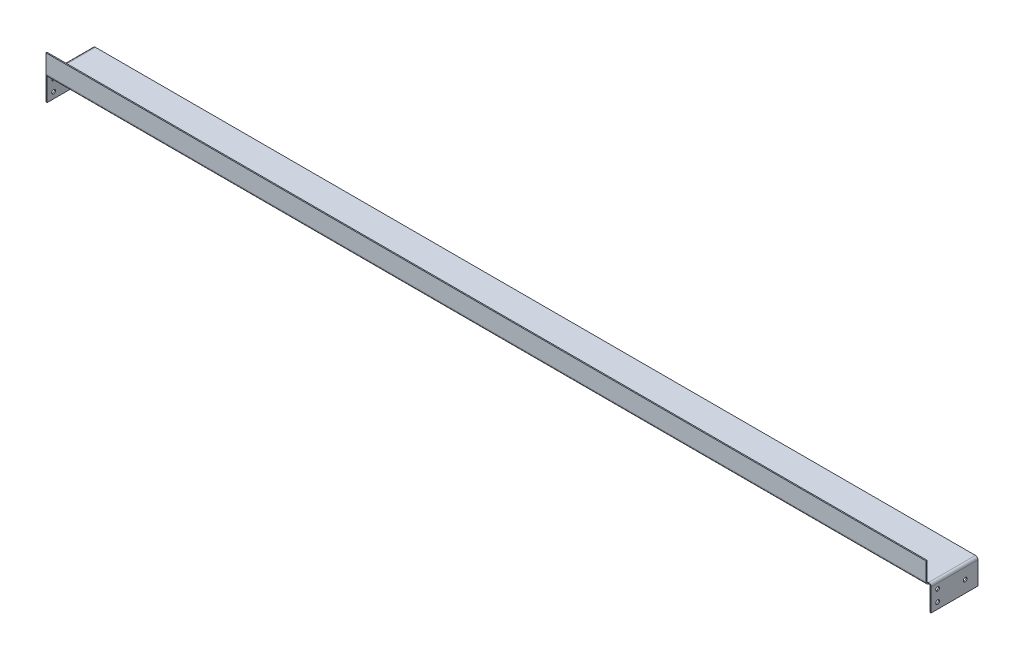
ISO-10303-21;
HEADER;
FILE_DESCRIPTION(('STEP AP214'),'2;1');
FILE_NAME('part.step','',(''),(''),'','','');
FILE_SCHEMA(('AUTOMOTIVE_DESIGN { 1 0 10303 214 1 1 1 1 }'));
ENDSEC;
DATA;
#1=APPLICATION_CONTEXT('core data for automotive mechanical design processes');
#2=APPLICATION_PROTOCOL_DEFINITION('international standard','automotive_design',2000,#1);
#3=PRODUCT_CONTEXT('',#1,'mechanical');
#4=PRODUCT('Part','Part','',(#3));
#5=PRODUCT_RELATED_PRODUCT_CATEGORY('part','',(#4));
#6=PRODUCT_DEFINITION_FORMATION('','',#4);
#7=PRODUCT_DEFINITION_CONTEXT('part definition',#1,'design');
#8=PRODUCT_DEFINITION('design','',#6,#7);
#9=PRODUCT_DEFINITION_SHAPE('','',#8);
#10=(LENGTH_UNIT() NAMED_UNIT(*) SI_UNIT(.MILLI.,.METRE.));
#11=(NAMED_UNIT(*) PLANE_ANGLE_UNIT() SI_UNIT($,.RADIAN.));
#12=(NAMED_UNIT(*) SI_UNIT($,.STERADIAN.) SOLID_ANGLE_UNIT());
#13=UNCERTAINTY_MEASURE_WITH_UNIT(LENGTH_MEASURE(1.E-05),#10,'distance_accuracy_value','');
#14=(GEOMETRIC_REPRESENTATION_CONTEXT(3) GLOBAL_UNCERTAINTY_ASSIGNED_CONTEXT((#13)) GLOBAL_UNIT_ASSIGNED_CONTEXT((#10,
#11,#12)) REPRESENTATION_CONTEXT('',''));
#15=CARTESIAN_POINT('',(0.,0.,0.));
#16=DIRECTION('',(0.,0.,1.));
#17=DIRECTION('',(1.,0.,0.));
#18=AXIS2_PLACEMENT_3D('',#15,#16,#17);
#19=CARTESIAN_POINT('',(-385.123575366,1131.04784336,59.2634000000001));
#20=DIRECTION('',(0.,-1.,0.));
#21=DIRECTION('',(-1.,0.,0.));
#22=AXIS2_PLACEMENT_3D('',#19,#20,#21);
#23=PLANE('',#22);
#24=DIRECTION('',(0.,0.,-1.));
#25=VECTOR('',#24,1.);
#26=CARTESIAN_POINT('',(-385.123575366,1131.04784336,59.2634000000001));
#27=LINE('',#26,#25);
#28=CARTESIAN_POINT('',(-385.123575366,1131.04784336,60.5634000000001));
#29=VERTEX_POINT('',#28);
#30=CARTESIAN_POINT('',(-385.123575366,1131.04784336,59.2634000000001));
#31=VERTEX_POINT('',#30);
#32=EDGE_CURVE('E13',#29,#31,#27,.T.);
#33=ORIENTED_EDGE('',*,*,#32,.F.);
#34=DIRECTION('',(-1.,0.,0.));
#35=VECTOR('',#34,1.);
#36=CARTESIAN_POINT('',(0.,1131.04784336,60.5634000000001));
#37=LINE('',#36,#35);
#38=CARTESIAN_POINT('',(661.403224634,1131.04784336,60.5634000000001));
#39=VERTEX_POINT('',#38);
#40=EDGE_CURVE('E154',#39,#29,#37,.T.);
#41=ORIENTED_EDGE('',*,*,#40,.F.);
#42=DIRECTION('',(0.,0.,-1.));
#43=VECTOR('',#42,1.);
#44=CARTESIAN_POINT('',(661.403224634,1131.04784336,59.2634000000001));
#45=LINE('',#44,#43);
#46=CARTESIAN_POINT('',(661.403224634,1131.04784336,59.2634000000001));
#47=VERTEX_POINT('',#46);
#48=EDGE_CURVE('E89',#39,#47,#45,.T.);
#49=ORIENTED_EDGE('',*,*,#48,.T.);
#50=DIRECTION('',(-1.,0.,0.));
#51=VECTOR('',#50,1.);
#52=CARTESIAN_POINT('',(-385.123575366,1131.04784336,59.2634000000001));
#53=LINE('',#52,#51);
#54=EDGE_CURVE('E332',#47,#31,#53,.T.);
#55=ORIENTED_EDGE('',*,*,#54,.T.);
#56=EDGE_LOOP('',(#33,#41,#49,#55));
#57=FACE_BOUND('',#56,.T.);
#58=ADVANCED_FACE('F79',(#57),#23,.F.);
#59=CARTESIAN_POINT('',(661.403224634,1131.04784336,59.2634000000001));
#60=DIRECTION('',(-1.,0.,0.));
#61=DIRECTION('',(0.,1.,0.));
#62=AXIS2_PLACEMENT_3D('',#59,#60,#61);
#63=PLANE('',#62);
#64=ORIENTED_EDGE('',*,*,#48,.F.);
#65=DIRECTION('',(0.,1.,0.));
#66=VECTOR('',#65,1.);
#67=CARTESIAN_POINT('',(661.403224634,0.,60.5634000000001));
#68=LINE('',#67,#66);
#69=CARTESIAN_POINT('',(661.403224634,1109.08784336,60.5634000000001));
#70=VERTEX_POINT('',#69);
#71=EDGE_CURVE('E151',#70,#39,#68,.T.);
#72=ORIENTED_EDGE('',*,*,#71,.F.);
#73=DIRECTION('',(0.,0.,-1.));
#74=VECTOR('',#73,1.);
#75=CARTESIAN_POINT('',(661.403224634,1109.08784336,59.2634000000001));
#76=LINE('',#75,#74);
#77=CARTESIAN_POINT('',(661.403224634,1109.08784336,59.2634000000001));
#78=VERTEX_POINT('',#77);
#79=EDGE_CURVE('E186',#70,#78,#76,.T.);
#80=ORIENTED_EDGE('',*,*,#79,.T.);
#81=DIRECTION('',(0.,1.,0.));
#82=VECTOR('',#81,1.);
#83=CARTESIAN_POINT('',(661.403224634,1131.04784336,59.2634000000001));
#84=LINE('',#83,#82);
#85=EDGE_CURVE('E325',#78,#47,#84,.T.);
#86=ORIENTED_EDGE('',*,*,#85,.T.);
#87=EDGE_LOOP('',(#64,#72,#80,#86));
#88=FACE_BOUND('',#87,.T.);
#89=ADVANCED_FACE('F365',(#88),#63,.F.);
#90=CARTESIAN_POINT('',(661.403224634,1109.08784336,57.5234000000001));
#91=DIRECTION('',(-1.,0.,0.));
#92=DIRECTION('',(0.,0.,1.));
#93=AXIS2_PLACEMENT_3D('',#90,#91,#92);
#94=PLANE('',#93);
#95=ORIENTED_EDGE('',*,*,#79,.F.);
#96=CARTESIAN_POINT('',(661.403224634,1109.08784336,57.5234000000001));
#97=DIRECTION('',(1.,0.,0.));
#98=DIRECTION('',(0.,0.,-1.));
#99=AXIS2_PLACEMENT_3D('',#96,#97,#98);
#100=CIRCLE('',#99,3.04);
#101=CARTESIAN_POINT('',(661.403224634,1106.04784336,57.5234));
#102=VERTEX_POINT('',#101);
#103=EDGE_CURVE('E147',#70,#102,#100,.T.);
#104=ORIENTED_EDGE('',*,*,#103,.T.);
#105=DIRECTION('',(0.,1.,0.));
#106=VECTOR('',#105,1.);
#107=CARTESIAN_POINT('',(661.403224634,1107.34784336,57.5234000000001));
#108=LINE('',#107,#106);
#109=CARTESIAN_POINT('',(661.403224634,1107.34784336,57.5234));
#110=VERTEX_POINT('',#109);
#111=EDGE_CURVE('E183',#102,#110,#108,.T.);
#112=ORIENTED_EDGE('',*,*,#111,.T.);
#113=CARTESIAN_POINT('',(661.403224634,1109.08784336,57.5234000000001));
#114=DIRECTION('',(1.,0.,0.));
#115=DIRECTION('',(0.,0.,-1.));
#116=AXIS2_PLACEMENT_3D('',#113,#114,#115);
#117=CIRCLE('',#116,1.74);
#118=EDGE_CURVE('E135',#78,#110,#117,.T.);
#119=ORIENTED_EDGE('',*,*,#118,.F.);
#120=EDGE_LOOP('',(#95,#104,#112,#119));
#121=FACE_BOUND('',#120,.T.);
#122=ADVANCED_FACE('F370',(#121),#94,.F.);
#123=CARTESIAN_POINT('',(22.9848635557314,1107.34784336,1.7366));
#124=DIRECTION('',(0.,0.,1.));
#125=DIRECTION('',(1.,0.,0.));
#126=AXIS2_PLACEMENT_3D('',#123,#124,#125);
#127=PLANE('',#126);
#128=DIRECTION('',(0.,1.,0.));
#129=VECTOR('',#128,1.);
#130=CARTESIAN_POINT('',(661.403224634,1107.34784336,1.7366));
#131=LINE('',#130,#129);
#132=CARTESIAN_POINT('',(661.403224634,1106.04784336,1.73660000000009));
#133=VERTEX_POINT('',#132);
#134=CARTESIAN_POINT('',(661.403224634,1107.34784336,1.7366));
#135=VERTEX_POINT('',#134);
#136=EDGE_CURVE('E180',#133,#135,#131,.T.);
#137=ORIENTED_EDGE('',*,*,#136,.F.);
#138=DIRECTION('',(1.,0.,0.));
#139=VECTOR('',#138,1.);
#140=CARTESIAN_POINT('',(22.9848635557314,1106.04784336,1.73660000000009));
#141=LINE('',#140,#139);
#142=CARTESIAN_POINT('',(-385.123575366,1106.04784336,1.73660000000009));
#143=VERTEX_POINT('',#142);
#144=EDGE_CURVE('E169',#143,#133,#141,.T.);
#145=ORIENTED_EDGE('',*,*,#144,.F.);
#146=DIRECTION('',(0.,1.,0.));
#147=VECTOR('',#146,1.);
#148=CARTESIAN_POINT('',(-385.123575366,1107.34784336,1.7366));
#149=LINE('',#148,#147);
#150=CARTESIAN_POINT('',(-385.123575366,1107.34784336,1.73660000000009));
#151=VERTEX_POINT('',#150);
#152=EDGE_CURVE('E177',#143,#151,#149,.T.);
#153=ORIENTED_EDGE('',*,*,#152,.T.);
#154=DIRECTION('',(1.,0.,0.));
#155=VECTOR('',#154,1.);
#156=CARTESIAN_POINT('',(22.9848635557314,1107.34784336,1.7366));
#157=LINE('',#156,#155);
#158=EDGE_CURVE('E322',#151,#135,#157,.T.);
#159=ORIENTED_EDGE('',*,*,#158,.T.);
#160=EDGE_LOOP('',(#137,#145,#153,#159));
#161=FACE_BOUND('',#160,.T.);
#162=ADVANCED_FACE('F479',(#161),#127,.F.);
#163=CARTESIAN_POINT('',(-385.123575365999,1109.08784336,57.5234000000001));
#164=DIRECTION('',(-1.,0.,0.));
#165=DIRECTION('',(0.,0.,1.));
#166=AXIS2_PLACEMENT_3D('',#163,#164,#165);
#167=PLANE('',#166);
#168=DIRECTION('',(2.55223683821897E-13,1.,0.));
#169=VECTOR('',#168,1.);
#170=CARTESIAN_POINT('',(-385.123575366,1107.34784336,57.5234000000001));
#171=LINE('',#170,#169);
#172=CARTESIAN_POINT('',(-385.123575366,1106.04784336,57.5234));
#173=VERTEX_POINT('',#172);
#174=CARTESIAN_POINT('',(-385.123575366,1107.34784336,57.5234000000001));
#175=VERTEX_POINT('',#174);
#176=EDGE_CURVE('E134',#173,#175,#171,.T.);
#177=ORIENTED_EDGE('',*,*,#176,.F.);
#178=CARTESIAN_POINT('',(-385.123575365999,1109.08784336,57.5234000000001));
#179=DIRECTION('',(1.,0.,0.));
#180=DIRECTION('',(0.,0.,-1.));
#181=AXIS2_PLACEMENT_3D('',#178,#179,#180);
#182=CIRCLE('',#181,3.04);
#183=CARTESIAN_POINT('',(-385.123575365999,1109.08784336,60.5634000000001));
#184=VERTEX_POINT('',#183);
#185=EDGE_CURVE('E144',#173,#184,#182,.F.);
#186=ORIENTED_EDGE('',*,*,#185,.T.);
#187=DIRECTION('',(0.,0.,-1.));
#188=VECTOR('',#187,1.);
#189=CARTESIAN_POINT('',(-385.123575365999,1109.08784336,59.2634000000001));
#190=LINE('',#189,#188);
#191=CARTESIAN_POINT('',(-385.123575365999,1109.08784336,59.2634000000001));
#192=VERTEX_POINT('',#191);
#193=EDGE_CURVE('E123',#184,#192,#190,.T.);
#194=ORIENTED_EDGE('',*,*,#193,.T.);
#195=CARTESIAN_POINT('',(-385.123575365999,1109.08784336,57.5234000000001));
#196=DIRECTION('',(1.,0.,0.));
#197=DIRECTION('',(0.,0.,-1.));
#198=AXIS2_PLACEMENT_3D('',#195,#196,#197);
#199=CIRCLE('',#198,1.74);
#200=EDGE_CURVE('E334',#175,#192,#199,.F.);
#201=ORIENTED_EDGE('',*,*,#200,.F.);
#202=EDGE_LOOP('',(#177,#186,#194,#201));
#203=FACE_BOUND('',#202,.T.);
#204=ADVANCED_FACE('F156',(#203),#167,.T.);
#205=CARTESIAN_POINT('',(-385.123575366,1107.34784336,59.2634000000001));
#206=DIRECTION('',(1.,0.,0.));
#207=DIRECTION('',(0.,-1.,0.));
#208=AXIS2_PLACEMENT_3D('',#205,#206,#207);
#209=PLANE('',#208);
#210=DIRECTION('',(0.,1.,0.));
#211=VECTOR('',#210,1.);
#212=CARTESIAN_POINT('',(-385.123575366,0.,60.5634000000001));
#213=LINE('',#212,#211);
#214=EDGE_CURVE('E126',#29,#184,#213,.F.);
#215=ORIENTED_EDGE('',*,*,#214,.F.);
#216=ORIENTED_EDGE('',*,*,#32,.T.);
#217=DIRECTION('',(0.,-1.,0.));
#218=VECTOR('',#217,1.);
#219=CARTESIAN_POINT('',(-385.123575366,1107.34784336,59.2634000000001));
#220=LINE('',#219,#218);
#221=EDGE_CURVE('E128',#31,#192,#220,.T.);
#222=ORIENTED_EDGE('',*,*,#221,.T.);
#223=ORIENTED_EDGE('',*,*,#193,.F.);
#224=EDGE_LOOP('',(#215,#216,#222,#223));
#225=FACE_BOUND('',#224,.T.);
#226=ADVANCED_FACE('F81',(#225),#209,.F.);
#227=CARTESIAN_POINT('',(661.403224634,1109.08784336,57.5234000000001));
#228=DIRECTION('',(1.,0.,0.));
#229=DIRECTION('',(0.,0.,1.));
#230=AXIS2_PLACEMENT_3D('',#227,#228,#229);
#231=CYLINDRICAL_SURFACE('',#230,1.74);
#232=DIRECTION('',(1.,0.,0.));
#233=VECTOR('',#232,1.);
#234=CARTESIAN_POINT('',(661.403224634,1107.34784336,57.5234000000001));
#235=LINE('',#234,#233);
#236=EDGE_CURVE('E316',#110,#175,#235,.F.);
#237=ORIENTED_EDGE('',*,*,#236,.T.);
#238=ORIENTED_EDGE('',*,*,#200,.T.);
#239=DIRECTION('',(1.,0.,0.));
#240=VECTOR('',#239,1.);
#241=CARTESIAN_POINT('',(-385.123575366,1109.08784336,59.2634000000001));
#242=LINE('',#241,#240);
#243=EDGE_CURVE('E328',#192,#78,#242,.T.);
#244=ORIENTED_EDGE('',*,*,#243,.T.);
#245=ORIENTED_EDGE('',*,*,#118,.T.);
#246=EDGE_LOOP('',(#237,#238,#244,#245));
#247=FACE_BOUND('',#246,.T.);
#248=ADVANCED_FACE('F373',(#247),#231,.F.);
#249=CARTESIAN_POINT('',(0.,0.,59.2634000000001));
#250=DIRECTION('',(0.,0.,-1.));
#251=DIRECTION('',(-1.,0.,0.));
#252=AXIS2_PLACEMENT_3D('',#249,#250,#251);
#253=PLANE('',#252);
#254=ORIENTED_EDGE('',*,*,#85,.F.);
#255=ORIENTED_EDGE('',*,*,#243,.F.);
#256=ORIENTED_EDGE('',*,*,#221,.F.);
#257=ORIENTED_EDGE('',*,*,#54,.F.);
#258=EDGE_LOOP('',(#254,#255,#256,#257));
#259=FACE_BOUND('',#258,.T.);
#260=ADVANCED_FACE('F369',(#259),#253,.T.);
#261=CARTESIAN_POINT('',(22.9848635557314,1107.34784336,1109.6918840007));
#262=DIRECTION('',(0.,1.,0.));
#263=DIRECTION('',(0.,0.,1.));
#264=AXIS2_PLACEMENT_3D('',#261,#262,#263);
#265=PLANE('',#264);
#266=DIRECTION('',(0.,0.,-1.));
#267=VECTOR('',#266,1.);
#268=CARTESIAN_POINT('',(-385.123575366,1107.34784336,1109.6918840007));
#269=LINE('',#268,#267);
#270=EDGE_CURVE('E160',#175,#151,#269,.T.);
#271=ORIENTED_EDGE('',*,*,#270,.F.);
#272=ORIENTED_EDGE('',*,*,#236,.F.);
#273=DIRECTION('',(0.,0.,-1.));
#274=VECTOR('',#273,1.);
#275=CARTESIAN_POINT('',(661.403224634,1107.34784336,1109.6918840007));
#276=LINE('',#275,#274);
#277=EDGE_CURVE('E319',#110,#135,#276,.T.);
#278=ORIENTED_EDGE('',*,*,#277,.T.);
#279=ORIENTED_EDGE('',*,*,#158,.F.);
#280=EDGE_LOOP('',(#271,#272,#278,#279));
#281=FACE_BOUND('',#280,.T.);
#282=ADVANCED_FACE('F491',(#281),#265,.T.);
#283=CARTESIAN_POINT('',(661.403224634,1109.08784336,57.5234000000001));
#284=DIRECTION('',(1.,0.,0.));
#285=DIRECTION('',(0.,0.,1.));
#286=AXIS2_PLACEMENT_3D('',#283,#284,#285);
#287=CYLINDRICAL_SURFACE('',#286,3.04);
#288=DIRECTION('',(1.,0.,0.));
#289=VECTOR('',#288,1.);
#290=CARTESIAN_POINT('',(661.403224634,1106.04784336,57.5234000000001));
#291=LINE('',#290,#289);
#292=EDGE_CURVE('E167',#102,#173,#291,.F.);
#293=ORIENTED_EDGE('',*,*,#292,.F.);
#294=ORIENTED_EDGE('',*,*,#103,.F.);
#295=DIRECTION('',(1.,0.,0.));
#296=VECTOR('',#295,1.);
#297=CARTESIAN_POINT('',(661.403224634,1109.08784336,60.5634000000001));
#298=LINE('',#297,#296);
#299=EDGE_CURVE('E141',#184,#70,#298,.T.);
#300=ORIENTED_EDGE('',*,*,#299,.F.);
#301=ORIENTED_EDGE('',*,*,#185,.F.);
#302=EDGE_LOOP('',(#293,#294,#300,#301));
#303=FACE_BOUND('',#302,.T.);
#304=ADVANCED_FACE('F143',(#303),#287,.T.);
#305=CARTESIAN_POINT('',(0.,0.,60.5634000000001));
#306=DIRECTION('',(0.,0.,-1.));
#307=DIRECTION('',(-1.,0.,0.));
#308=AXIS2_PLACEMENT_3D('',#305,#306,#307);
#309=PLANE('',#308);
#310=ORIENTED_EDGE('',*,*,#71,.T.);
#311=ORIENTED_EDGE('',*,*,#40,.T.);
#312=ORIENTED_EDGE('',*,*,#214,.T.);
#313=ORIENTED_EDGE('',*,*,#299,.T.);
#314=EDGE_LOOP('',(#310,#311,#312,#313));
#315=FACE_BOUND('',#314,.T.);
#316=ADVANCED_FACE('F153',(#315),#309,.F.);
#317=CARTESIAN_POINT('',(22.9848635557314,1106.04784336,1109.6918840007));
#318=DIRECTION('',(0.,1.,0.));
#319=DIRECTION('',(0.,0.,1.));
#320=AXIS2_PLACEMENT_3D('',#317,#318,#319);
#321=PLANE('',#320);
#322=DIRECTION('',(0.,0.,1.));
#323=VECTOR('',#322,1.);
#324=CARTESIAN_POINT('',(-385.123575366,1106.04784336,1109.6918840007));
#325=LINE('',#324,#323);
#326=EDGE_CURVE('E165',#173,#143,#325,.F.);
#327=ORIENTED_EDGE('',*,*,#326,.T.);
#328=ORIENTED_EDGE('',*,*,#144,.T.);
#329=DIRECTION('',(0.,0.,1.));
#330=VECTOR('',#329,1.);
#331=CARTESIAN_POINT('',(661.403224634,1106.04784336,1109.6918840007));
#332=LINE('',#331,#330);
#333=EDGE_CURVE('E172',#102,#133,#332,.F.);
#334=ORIENTED_EDGE('',*,*,#333,.F.);
#335=ORIENTED_EDGE('',*,*,#292,.T.);
#336=EDGE_LOOP('',(#327,#328,#334,#335));
#337=FACE_BOUND('',#336,.T.);
#338=ADVANCED_FACE('F339',(#337),#321,.F.);
#339=CARTESIAN_POINT('',(661.403224634,1104.30784336,1.73660000000009));
#340=DIRECTION('',(0.,0.,-1.));
#341=DIRECTION('',(-1.,0.,0.));
#342=AXIS2_PLACEMENT_3D('',#339,#340,#341);
#343=PLANE('',#342);
#344=DIRECTION('',(1.,0.,0.));
#345=VECTOR('',#344,1.);
#346=CARTESIAN_POINT('',(664.443224634,1104.30784336,1.73660000000008));
#347=LINE('',#346,#345);
#348=CARTESIAN_POINT('',(663.143224634,1104.30784336,1.73660000000009));
#349=VERTEX_POINT('',#348);
#350=CARTESIAN_POINT('',(664.443224634,1104.30784336,1.73660000000009));
#351=VERTEX_POINT('',#350);
#352=EDGE_CURVE('E259',#349,#351,#347,.T.);
#353=ORIENTED_EDGE('',*,*,#352,.F.);
#354=CARTESIAN_POINT('',(661.403224634,1104.30784336,1.73660000000009));
#355=DIRECTION('',(0.,0.,1.));
#356=DIRECTION('',(1.,0.,0.));
#357=AXIS2_PLACEMENT_3D('',#354,#355,#356);
#358=CIRCLE('',#357,1.74000000000007);
#359=EDGE_CURVE('E309',#133,#349,#358,.F.);
#360=ORIENTED_EDGE('',*,*,#359,.F.);
#361=ORIENTED_EDGE('',*,*,#136,.T.);
#362=CARTESIAN_POINT('',(661.403224634,1104.30784336,1.73660000000009));
#363=DIRECTION('',(0.,0.,1.));
#364=DIRECTION('',(1.,0.,0.));
#365=AXIS2_PLACEMENT_3D('',#362,#363,#364);
#366=CIRCLE('',#365,3.04000000000007);
#367=EDGE_CURVE('E168',#135,#351,#366,.F.);
#368=ORIENTED_EDGE('',*,*,#367,.T.);
#369=EDGE_LOOP('',(#353,#360,#361,#368));
#370=FACE_BOUND('',#369,.T.);
#371=ADVANCED_FACE('F452',(#370),#343,.T.);
#372=CARTESIAN_POINT('',(661.403224634,1104.30784336,57.5234));
#373=DIRECTION('',(0.,0.,-1.));
#374=DIRECTION('',(-1.,0.,0.));
#375=AXIS2_PLACEMENT_3D('',#372,#373,#374);
#376=PLANE('',#375);
#377=CARTESIAN_POINT('',(661.403224634,1104.30784336,57.5234));
#378=DIRECTION('',(0.,0.,1.));
#379=DIRECTION('',(1.,0.,0.));
#380=AXIS2_PLACEMENT_3D('',#377,#378,#379);
#381=CIRCLE('',#380,1.74000000000007);
#382=CARTESIAN_POINT('',(663.143224634,1104.30784336,57.5234));
#383=VERTEX_POINT('',#382);
#384=EDGE_CURVE('E271',#383,#102,#381,.T.);
#385=ORIENTED_EDGE('',*,*,#384,.F.);
#386=DIRECTION('',(1.,0.,0.));
#387=VECTOR('',#386,1.);
#388=CARTESIAN_POINT('',(663.143224634,1104.30784336,57.5234));
#389=LINE('',#388,#387);
#390=CARTESIAN_POINT('',(664.443224634,1104.30784336,57.5234));
#391=VERTEX_POINT('',#390);
#392=EDGE_CURVE('E296',#383,#391,#389,.T.);
#393=ORIENTED_EDGE('',*,*,#392,.T.);
#394=CARTESIAN_POINT('',(661.403224634,1104.30784336,57.5234));
#395=DIRECTION('',(0.,0.,1.));
#396=DIRECTION('',(1.,0.,0.));
#397=AXIS2_PLACEMENT_3D('',#394,#395,#396);
#398=CIRCLE('',#397,3.04000000000007);
#399=EDGE_CURVE('E306',#391,#110,#398,.T.);
#400=ORIENTED_EDGE('',*,*,#399,.T.);
#401=ORIENTED_EDGE('',*,*,#111,.F.);
#402=EDGE_LOOP('',(#385,#393,#400,#401));
#403=FACE_BOUND('',#402,.T.);
#404=ADVANCED_FACE('F433',(#403),#376,.F.);
#405=CARTESIAN_POINT('',(661.403224634,1104.30784336,57.5234));
#406=DIRECTION('',(0.,0.,1.));
#407=DIRECTION('',(1.,0.,0.));
#408=AXIS2_PLACEMENT_3D('',#405,#406,#407);
#409=CYLINDRICAL_SURFACE('',#408,3.04000000000007);
#410=ORIENTED_EDGE('',*,*,#277,.F.);
#411=ORIENTED_EDGE('',*,*,#399,.F.);
#412=DIRECTION('',(0.,0.,1.));
#413=VECTOR('',#412,1.);
#414=CARTESIAN_POINT('',(664.443224634,1104.30784336,0.));
#415=LINE('',#414,#413);
#416=EDGE_CURVE('E293',#351,#391,#415,.T.);
#417=ORIENTED_EDGE('',*,*,#416,.F.);
#418=ORIENTED_EDGE('',*,*,#367,.F.);
#419=EDGE_LOOP('',(#410,#411,#417,#418));
#420=FACE_BOUND('',#419,.T.);
#421=ADVANCED_FACE('F432',(#420),#409,.T.);
#422=CARTESIAN_POINT('',(661.403224634,1104.30784336,57.5234));
#423=DIRECTION('',(0.,0.,1.));
#424=DIRECTION('',(1.,0.,0.));
#425=AXIS2_PLACEMENT_3D('',#422,#423,#424);
#426=CYLINDRICAL_SURFACE('',#425,1.74000000000007);
#427=ORIENTED_EDGE('',*,*,#333,.T.);
#428=ORIENTED_EDGE('',*,*,#359,.T.);
#429=DIRECTION('',(0.,0.,-1.));
#430=VECTOR('',#429,1.);
#431=CARTESIAN_POINT('',(663.143224634,1104.30784336,1.73660000000004));
#432=LINE('',#431,#430);
#433=EDGE_CURVE('E299',#349,#383,#432,.F.);
#434=ORIENTED_EDGE('',*,*,#433,.T.);
#435=ORIENTED_EDGE('',*,*,#384,.T.);
#436=EDGE_LOOP('',(#427,#428,#434,#435));
#437=FACE_BOUND('',#436,.T.);
#438=ADVANCED_FACE('F456',(#437),#426,.F.);
#439=CARTESIAN_POINT('',(664.443224634,1106.04784336,57.5234));
#440=DIRECTION('',(0.,0.,1.));
#441=DIRECTION('',(0.,-1.,0.));
#442=AXIS2_PLACEMENT_3D('',#439,#440,#441);
#443=PLANE('',#442);
#444=DIRECTION('',(0.,1.,0.));
#445=VECTOR('',#444,1.);
#446=CARTESIAN_POINT('',(664.443224634,1106.04784336,57.5234));
#447=LINE('',#446,#445);
#448=CARTESIAN_POINT('',(664.443224634,1077.34784336,57.5234000000001));
#449=VERTEX_POINT('',#448);
#450=EDGE_CURVE('E275',#449,#391,#447,.T.);
#451=ORIENTED_EDGE('',*,*,#450,.T.);
#452=ORIENTED_EDGE('',*,*,#392,.F.);
#453=DIRECTION('',(0.,-1.,0.));
#454=VECTOR('',#453,1.);
#455=CARTESIAN_POINT('',(663.143224634004,2.71153816447778E-12,57.5234000000029));
#456=LINE('',#455,#454);
#457=CARTESIAN_POINT('',(663.143224634,1077.34784336,57.5234000000001));
#458=VERTEX_POINT('',#457);
#459=EDGE_CURVE('E284',#458,#383,#456,.F.);
#460=ORIENTED_EDGE('',*,*,#459,.F.);
#461=DIRECTION('',(-1.,0.,0.));
#462=VECTOR('',#461,1.);
#463=CARTESIAN_POINT('',(664.443224634,1077.34784336,57.5234000000001));
#464=LINE('',#463,#462);
#465=EDGE_CURVE('E268',#449,#458,#464,.T.);
#466=ORIENTED_EDGE('',*,*,#465,.F.);
#467=EDGE_LOOP('',(#451,#452,#460,#466));
#468=FACE_BOUND('',#467,.T.);
#469=ADVANCED_FACE('F442',(#468),#443,.T.);
#470=CARTESIAN_POINT('',(664.443224634,1077.34784336,1.7366));
#471=DIRECTION('',(0.,0.,-1.));
#472=DIRECTION('',(0.,1.,0.));
#473=AXIS2_PLACEMENT_3D('',#470,#471,#472);
#474=PLANE('',#473);
#475=DIRECTION('',(0.,1.,0.));
#476=VECTOR('',#475,1.);
#477=CARTESIAN_POINT('',(663.143224634004,2.55322729703797E-12,1.7365999999967));
#478=LINE('',#477,#476);
#479=CARTESIAN_POINT('',(663.143224634,1077.34784336,1.7366));
#480=VERTEX_POINT('',#479);
#481=EDGE_CURVE('E290',#349,#480,#478,.F.);
#482=ORIENTED_EDGE('',*,*,#481,.F.);
#483=ORIENTED_EDGE('',*,*,#352,.T.);
#484=DIRECTION('',(0.,-1.,0.));
#485=VECTOR('',#484,1.);
#486=CARTESIAN_POINT('',(664.443224634,1077.34784336,1.7366));
#487=LINE('',#486,#485);
#488=CARTESIAN_POINT('',(664.443224634,1077.34784336,1.7366));
#489=VERTEX_POINT('',#488);
#490=EDGE_CURVE('E281',#351,#489,#487,.T.);
#491=ORIENTED_EDGE('',*,*,#490,.T.);
#492=DIRECTION('',(-1.,0.,0.));
#493=VECTOR('',#492,1.);
#494=CARTESIAN_POINT('',(664.443224634,1077.34784336,1.7366));
#495=LINE('',#494,#493);
#496=EDGE_CURVE('E272',#489,#480,#495,.T.);
#497=ORIENTED_EDGE('',*,*,#496,.T.);
#498=EDGE_LOOP('',(#482,#483,#491,#497));
#499=FACE_BOUND('',#498,.T.);
#500=ADVANCED_FACE('F449',(#499),#474,.T.);
#501=CARTESIAN_POINT('',(664.443224634004,2.56309324124571E-12,0.));
#502=DIRECTION('',(1.,0.,0.));
#503=DIRECTION('',(0.,1.,0.));
#504=AXIS2_PLACEMENT_3D('',#501,#502,#503);
#505=PLANE('',#504);
#506=CARTESIAN_POINT('',(664.443224634,1098.37784336,49.7434000000001));
#507=DIRECTION('',(1.,0.,0.));
#508=DIRECTION('',(0.,1.,0.));
#509=AXIS2_PLACEMENT_3D('',#506,#507,#508);
#510=CIRCLE('',#509,2.25000000000007);
#511=CARTESIAN_POINT('',(664.443224634,1100.62784336,49.7434000000001));
#512=VERTEX_POINT('',#511);
#513=EDGE_CURVE('E193',#512,#512,#510,.T.);
#514=ORIENTED_EDGE('',*,*,#513,.F.);
#515=EDGE_LOOP('',(#514));
#516=FACE_BOUND('',#515,.T.);
#517=CARTESIAN_POINT('',(664.443224634,1084.75784336,49.7434000000001));
#518=DIRECTION('',(1.,0.,0.));
#519=DIRECTION('',(0.,1.,0.));
#520=AXIS2_PLACEMENT_3D('',#517,#518,#519);
#521=CIRCLE('',#520,2.25000000000006);
#522=CARTESIAN_POINT('',(664.443224634,1087.00784336,49.7434000000001));
#523=VERTEX_POINT('',#522);
#524=EDGE_CURVE('E861',#523,#523,#521,.T.);
#525=ORIENTED_EDGE('',*,*,#524,.F.);
#526=EDGE_LOOP('',(#525));
#527=FACE_BOUND('',#526,.T.);
#528=CARTESIAN_POINT('',(664.443224634,1091.47784336,16.9466000000001));
#529=DIRECTION('',(1.,0.,0.));
#530=DIRECTION('',(0.,1.,0.));
#531=AXIS2_PLACEMENT_3D('',#528,#529,#530);
#532=CIRCLE('',#531,2.25000000000001);
#533=CARTESIAN_POINT('',(664.443224634,1093.72784336,16.9466000000001));
#534=VERTEX_POINT('',#533);
#535=EDGE_CURVE('E864',#534,#534,#532,.T.);
#536=ORIENTED_EDGE('',*,*,#535,.F.);
#537=EDGE_LOOP('',(#536));
#538=FACE_BOUND('',#537,.T.);
#539=ORIENTED_EDGE('',*,*,#490,.F.);
#540=ORIENTED_EDGE('',*,*,#416,.T.);
#541=ORIENTED_EDGE('',*,*,#450,.F.);
#542=DIRECTION('',(0.,0.,1.));
#543=VECTOR('',#542,1.);
#544=CARTESIAN_POINT('',(664.443224634,1077.34784336,57.5234000000001));
#545=LINE('',#544,#543);
#546=EDGE_CURVE('E278',#489,#449,#545,.T.);
#547=ORIENTED_EDGE('',*,*,#546,.F.);
#548=EDGE_LOOP('',(#539,#540,#541,#547));
#549=FACE_BOUND('',#548,.T.);
#550=ADVANCED_FACE('F440',(#516,#527,#538,#549),#505,.T.);
#551=CARTESIAN_POINT('',(663.143224634004,2.55855431550522E-12,0.));
#552=DIRECTION('',(1.,0.,0.));
#553=DIRECTION('',(0.,1.,0.));
#554=AXIS2_PLACEMENT_3D('',#551,#552,#553);
#555=PLANE('',#554);
#556=CARTESIAN_POINT('',(663.143224634,1098.37784336,49.7434000000001));
#557=DIRECTION('',(1.,0.,0.));
#558=DIRECTION('',(0.,1.,0.));
#559=AXIS2_PLACEMENT_3D('',#556,#557,#558);
#560=CIRCLE('',#559,2.25000000000007);
#561=CARTESIAN_POINT('',(663.143224634,1100.62784336,49.7434000000001));
#562=VERTEX_POINT('',#561);
#563=EDGE_CURVE('E216',#562,#562,#560,.T.);
#564=ORIENTED_EDGE('',*,*,#563,.T.);
#565=EDGE_LOOP('',(#564));
#566=FACE_BOUND('',#565,.T.);
#567=CARTESIAN_POINT('',(663.143224634,1084.75784336,49.7434000000001));
#568=DIRECTION('',(1.,0.,0.));
#569=DIRECTION('',(0.,1.,0.));
#570=AXIS2_PLACEMENT_3D('',#567,#568,#569);
#571=CIRCLE('',#570,2.25000000000006);
#572=CARTESIAN_POINT('',(663.143224634,1087.00784336,49.7434000000001));
#573=VERTEX_POINT('',#572);
#574=EDGE_CURVE('E201',#573,#573,#571,.T.);
#575=ORIENTED_EDGE('',*,*,#574,.T.);
#576=EDGE_LOOP('',(#575));
#577=FACE_BOUND('',#576,.T.);
#578=CARTESIAN_POINT('',(663.143224634,1091.47784336,16.9466000000001));
#579=DIRECTION('',(1.,0.,0.));
#580=DIRECTION('',(0.,1.,0.));
#581=AXIS2_PLACEMENT_3D('',#578,#579,#580);
#582=CIRCLE('',#581,2.25000000000001);
#583=CARTESIAN_POINT('',(663.143224634,1093.72784336,16.9466000000001));
#584=VERTEX_POINT('',#583);
#585=EDGE_CURVE('E197',#584,#584,#582,.T.);
#586=ORIENTED_EDGE('',*,*,#585,.T.);
#587=EDGE_LOOP('',(#586));
#588=FACE_BOUND('',#587,.T.);
#589=ORIENTED_EDGE('',*,*,#433,.F.);
#590=ORIENTED_EDGE('',*,*,#481,.T.);
#591=DIRECTION('',(0.,0.,-1.));
#592=VECTOR('',#591,1.);
#593=CARTESIAN_POINT('',(663.143224634,1077.34784336,0.));
#594=LINE('',#593,#592);
#595=EDGE_CURVE('E287',#480,#458,#594,.F.);
#596=ORIENTED_EDGE('',*,*,#595,.T.);
#597=ORIENTED_EDGE('',*,*,#459,.T.);
#598=EDGE_LOOP('',(#589,#590,#596,#597));
#599=FACE_BOUND('',#598,.T.);
#600=ADVANCED_FACE('F458',(#566,#577,#588,#599),#555,.F.);
#601=CARTESIAN_POINT('',(664.443224634,1077.34784336,57.5234000000001));
#602=DIRECTION('',(0.,-1.,0.));
#603=DIRECTION('',(1.,0.,0.));
#604=AXIS2_PLACEMENT_3D('',#601,#602,#603);
#605=PLANE('',#604);
#606=ORIENTED_EDGE('',*,*,#595,.F.);
#607=ORIENTED_EDGE('',*,*,#496,.F.);
#608=ORIENTED_EDGE('',*,*,#546,.T.);
#609=ORIENTED_EDGE('',*,*,#465,.T.);
#610=EDGE_LOOP('',(#606,#607,#608,#609));
#611=FACE_BOUND('',#610,.T.);
#612=ADVANCED_FACE('F446',(#611),#605,.T.);
#613=CARTESIAN_POINT('',(-385.123575366,1104.30784336,57.5234));
#614=DIRECTION('',(0.,0.,1.));
#615=DIRECTION('',(1.,0.,0.));
#616=AXIS2_PLACEMENT_3D('',#613,#614,#615);
#617=PLANE('',#616);
#618=DIRECTION('',(-1.,0.,0.));
#619=VECTOR('',#618,1.);
#620=CARTESIAN_POINT('',(-388.163575366,1104.30784336,57.5234));
#621=LINE('',#620,#619);
#622=CARTESIAN_POINT('',(-386.863575366,1104.30784336,57.5234));
#623=VERTEX_POINT('',#622);
#624=CARTESIAN_POINT('',(-388.163575366,1104.30784336,57.5234));
#625=VERTEX_POINT('',#624);
#626=EDGE_CURVE('E219',#623,#625,#621,.T.);
#627=ORIENTED_EDGE('',*,*,#626,.F.);
#628=CARTESIAN_POINT('',(-385.123575366,1104.30784336,57.5234));
#629=DIRECTION('',(0.,0.,-1.));
#630=DIRECTION('',(-1.,0.,0.));
#631=AXIS2_PLACEMENT_3D('',#628,#629,#630);
#632=CIRCLE('',#631,1.74000000000007);
#633=EDGE_CURVE('E263',#173,#623,#632,.F.);
#634=ORIENTED_EDGE('',*,*,#633,.F.);
#635=ORIENTED_EDGE('',*,*,#176,.T.);
#636=CARTESIAN_POINT('',(-385.123575366,1104.30784336,57.5234));
#637=DIRECTION('',(0.,0.,-1.));
#638=DIRECTION('',(-1.,0.,0.));
#639=AXIS2_PLACEMENT_3D('',#636,#637,#638);
#640=CIRCLE('',#639,3.04000000000007);
#641=EDGE_CURVE('E256',#175,#625,#640,.F.);
#642=ORIENTED_EDGE('',*,*,#641,.T.);
#643=EDGE_LOOP('',(#627,#634,#635,#642));
#644=FACE_BOUND('',#643,.T.);
#645=ADVANCED_FACE('F379',(#644),#617,.T.);
#646=CARTESIAN_POINT('',(-385.123575366,1104.30784336,1.73660000000009));
#647=DIRECTION('',(0.,0.,1.));
#648=DIRECTION('',(1.,0.,0.));
#649=AXIS2_PLACEMENT_3D('',#646,#647,#648);
#650=PLANE('',#649);
#651=CARTESIAN_POINT('',(-385.123575366,1104.30784336,1.73660000000009));
#652=DIRECTION('',(0.,0.,-1.));
#653=DIRECTION('',(-1.,0.,0.));
#654=AXIS2_PLACEMENT_3D('',#651,#652,#653);
#655=CIRCLE('',#654,1.74000000000007);
#656=CARTESIAN_POINT('',(-386.863575366,1104.30784336,1.73660000000009));
#657=VERTEX_POINT('',#656);
#658=EDGE_CURVE('E223',#657,#143,#655,.T.);
#659=ORIENTED_EDGE('',*,*,#658,.F.);
#660=DIRECTION('',(-1.,0.,0.));
#661=VECTOR('',#660,1.);
#662=CARTESIAN_POINT('',(-386.863575366,1104.30784336,1.73660000000009));
#663=LINE('',#662,#661);
#664=CARTESIAN_POINT('',(-388.163575366,1104.30784336,1.73660000000009));
#665=VERTEX_POINT('',#664);
#666=EDGE_CURVE('E248',#657,#665,#663,.T.);
#667=ORIENTED_EDGE('',*,*,#666,.T.);
#668=CARTESIAN_POINT('',(-385.123575366,1104.30784336,1.73660000000009));
#669=DIRECTION('',(0.,0.,-1.));
#670=DIRECTION('',(-1.,0.,0.));
#671=AXIS2_PLACEMENT_3D('',#668,#669,#670);
#672=CIRCLE('',#671,3.04000000000007);
#673=EDGE_CURVE('E260',#665,#151,#672,.T.);
#674=ORIENTED_EDGE('',*,*,#673,.T.);
#675=ORIENTED_EDGE('',*,*,#152,.F.);
#676=EDGE_LOOP('',(#659,#667,#674,#675));
#677=FACE_BOUND('',#676,.T.);
#678=ADVANCED_FACE('F665',(#677),#650,.F.);
#679=CARTESIAN_POINT('',(-385.123575366,1104.30784336,1.73660000000009));
#680=DIRECTION('',(0.,0.,-1.));
#681=DIRECTION('',(-1.,0.,0.));
#682=AXIS2_PLACEMENT_3D('',#679,#680,#681);
#683=CYLINDRICAL_SURFACE('',#682,3.04000000000007);
#684=ORIENTED_EDGE('',*,*,#270,.T.);
#685=ORIENTED_EDGE('',*,*,#673,.F.);
#686=DIRECTION('',(0.,0.,-1.));
#687=VECTOR('',#686,1.);
#688=CARTESIAN_POINT('',(-388.163575366,1104.30784336,57.5234));
#689=LINE('',#688,#687);
#690=EDGE_CURVE('E245',#665,#625,#689,.F.);
#691=ORIENTED_EDGE('',*,*,#690,.T.);
#692=ORIENTED_EDGE('',*,*,#641,.F.);
#693=EDGE_LOOP('',(#684,#685,#691,#692));
#694=FACE_BOUND('',#693,.T.);
#695=ADVANCED_FACE('F382',(#694),#683,.T.);
#696=CARTESIAN_POINT('',(-385.123575366,1104.30784336,1.73660000000009));
#697=DIRECTION('',(0.,0.,-1.));
#698=DIRECTION('',(-1.,0.,0.));
#699=AXIS2_PLACEMENT_3D('',#696,#697,#698);
#700=CYLINDRICAL_SURFACE('',#699,1.74000000000007);
#701=ORIENTED_EDGE('',*,*,#326,.F.);
#702=ORIENTED_EDGE('',*,*,#633,.T.);
#703=DIRECTION('',(0.,0.,-1.));
#704=VECTOR('',#703,1.);
#705=CARTESIAN_POINT('',(-386.863575366,1104.30784336,57.5234));
#706=LINE('',#705,#704);
#707=EDGE_CURVE('E251',#623,#657,#706,.T.);
#708=ORIENTED_EDGE('',*,*,#707,.T.);
#709=ORIENTED_EDGE('',*,*,#658,.T.);
#710=EDGE_LOOP('',(#701,#702,#708,#709));
#711=FACE_BOUND('',#710,.T.);
#712=ADVANCED_FACE('F646',(#711),#700,.F.);
#713=CARTESIAN_POINT('',(-388.163575366,1106.04784336,57.5234));
#714=DIRECTION('',(0.,0.,1.));
#715=DIRECTION('',(1.,0.,0.));
#716=AXIS2_PLACEMENT_3D('',#713,#714,#715);
#717=PLANE('',#716);
#718=DIRECTION('',(0.,-1.,0.));
#719=VECTOR('',#718,1.);
#720=CARTESIAN_POINT('',(-386.863575366004,1.48980160521707E-12,57.5234));
#721=LINE('',#720,#719);
#722=CARTESIAN_POINT('',(-386.863575366,1077.34784336,57.5234));
#723=VERTEX_POINT('',#722);
#724=EDGE_CURVE('E242',#623,#723,#721,.T.);
#725=ORIENTED_EDGE('',*,*,#724,.F.);
#726=ORIENTED_EDGE('',*,*,#626,.T.);
#727=DIRECTION('',(0.,1.,0.));
#728=VECTOR('',#727,1.);
#729=CARTESIAN_POINT('',(-388.163575366,1106.04784336,57.5234));
#730=LINE('',#729,#728);
#731=CARTESIAN_POINT('',(-388.163575366,1077.34784336,57.5234));
#732=VERTEX_POINT('',#731);
#733=EDGE_CURVE('E233',#625,#732,#730,.F.);
#734=ORIENTED_EDGE('',*,*,#733,.T.);
#735=DIRECTION('',(1.,0.,0.));
#736=VECTOR('',#735,1.);
#737=CARTESIAN_POINT('',(-388.163575366,1077.34784336,57.5234));
#738=LINE('',#737,#736);
#739=EDGE_CURVE('E224',#732,#723,#738,.T.);
#740=ORIENTED_EDGE('',*,*,#739,.T.);
#741=EDGE_LOOP('',(#725,#726,#734,#740));
#742=FACE_BOUND('',#741,.T.);
#743=ADVANCED_FACE('F638',(#742),#717,.T.);
#744=CARTESIAN_POINT('',(-388.163575366,1077.34784336,1.73660000000009));
#745=DIRECTION('',(0.,0.,-1.));
#746=DIRECTION('',(-1.,0.,0.));
#747=AXIS2_PLACEMENT_3D('',#744,#745,#746);
#748=PLANE('',#747);
#749=DIRECTION('',(0.,-1.,0.));
#750=VECTOR('',#749,1.);
#751=CARTESIAN_POINT('',(-388.163575366,1077.34784336,1.73660000000009));
#752=LINE('',#751,#750);
#753=CARTESIAN_POINT('',(-388.163575366,1077.34784336,1.73660000000009));
#754=VERTEX_POINT('',#753);
#755=EDGE_CURVE('E227',#754,#665,#752,.F.);
#756=ORIENTED_EDGE('',*,*,#755,.T.);
#757=ORIENTED_EDGE('',*,*,#666,.F.);
#758=DIRECTION('',(0.,1.,0.));
#759=VECTOR('',#758,1.);
#760=CARTESIAN_POINT('',(-386.863575366004,1.48980160521707E-12,1.73660000000009));
#761=LINE('',#760,#759);
#762=CARTESIAN_POINT('',(-386.863575366,1077.34784336,1.73660000000009));
#763=VERTEX_POINT('',#762);
#764=EDGE_CURVE('E236',#763,#657,#761,.T.);
#765=ORIENTED_EDGE('',*,*,#764,.F.);
#766=DIRECTION('',(1.,0.,0.));
#767=VECTOR('',#766,1.);
#768=CARTESIAN_POINT('',(-388.163575366,1077.34784336,1.73660000000009));
#769=LINE('',#768,#767);
#770=EDGE_CURVE('E220',#754,#763,#769,.T.);
#771=ORIENTED_EDGE('',*,*,#770,.F.);
#772=EDGE_LOOP('',(#756,#757,#765,#771));
#773=FACE_BOUND('',#772,.T.);
#774=ADVANCED_FACE('F400',(#773),#748,.T.);
#775=CARTESIAN_POINT('',(-388.163575366004,1.49434053095757E-12,0.));
#776=DIRECTION('',(1.,0.,0.));
#777=DIRECTION('',(0.,1.,0.));
#778=AXIS2_PLACEMENT_3D('',#775,#776,#777);
#779=PLANE('',#778);
#780=CARTESIAN_POINT('',(-388.163575366,1098.37784336,49.7434000000001));
#781=DIRECTION('',(1.,0.,0.));
#782=DIRECTION('',(0.,1.,0.));
#783=AXIS2_PLACEMENT_3D('',#780,#781,#782);
#784=CIRCLE('',#783,2.25000000000007);
#785=CARTESIAN_POINT('',(-388.163575366,1100.62784336,49.7434000000001));
#786=VERTEX_POINT('',#785);
#787=EDGE_CURVE('E213',#786,#786,#784,.T.);
#788=ORIENTED_EDGE('',*,*,#787,.T.);
#789=EDGE_LOOP('',(#788));
#790=FACE_BOUND('',#789,.T.);
#791=CARTESIAN_POINT('',(-388.163575366,1084.75784336,49.7434000000001));
#792=DIRECTION('',(1.,0.,0.));
#793=DIRECTION('',(0.,1.,0.));
#794=AXIS2_PLACEMENT_3D('',#791,#792,#793);
#795=CIRCLE('',#794,2.25000000000006);
#796=CARTESIAN_POINT('',(-388.163575366,1087.00784336,49.7434000000001));
#797=VERTEX_POINT('',#796);
#798=EDGE_CURVE('E196',#797,#797,#795,.T.);
#799=ORIENTED_EDGE('',*,*,#798,.T.);
#800=EDGE_LOOP('',(#799));
#801=FACE_BOUND('',#800,.T.);
#802=CARTESIAN_POINT('',(-388.163575366,1091.47784336,16.9466000000001));
#803=DIRECTION('',(1.,0.,0.));
#804=DIRECTION('',(0.,1.,0.));
#805=AXIS2_PLACEMENT_3D('',#802,#803,#804);
#806=CIRCLE('',#805,2.25000000000001);
#807=CARTESIAN_POINT('',(-388.163575366,1093.72784336,16.9466000000001));
#808=VERTEX_POINT('',#807);
#809=EDGE_CURVE('E192',#808,#808,#806,.T.);
#810=ORIENTED_EDGE('',*,*,#809,.T.);
#811=EDGE_LOOP('',(#810));
#812=FACE_BOUND('',#811,.T.);
#813=ORIENTED_EDGE('',*,*,#690,.F.);
#814=ORIENTED_EDGE('',*,*,#755,.F.);
#815=DIRECTION('',(0.,0.,1.));
#816=VECTOR('',#815,1.);
#817=CARTESIAN_POINT('',(-388.163575366,1077.34784336,57.5234));
#818=LINE('',#817,#816);
#819=EDGE_CURVE('E230',#732,#754,#818,.F.);
#820=ORIENTED_EDGE('',*,*,#819,.F.);
#821=ORIENTED_EDGE('',*,*,#733,.F.);
#822=EDGE_LOOP('',(#813,#814,#820,#821));
#823=FACE_BOUND('',#822,.T.);
#824=ADVANCED_FACE('F392',(#790,#801,#812,#823),#779,.F.);
#825=CARTESIAN_POINT('',(-386.863575366004,1.48980160521707E-12,0.));
#826=DIRECTION('',(1.,0.,0.));
#827=DIRECTION('',(0.,1.,0.));
#828=AXIS2_PLACEMENT_3D('',#825,#826,#827);
#829=PLANE('',#828);
#830=CARTESIAN_POINT('',(-386.863575366,1098.37784336,49.7434000000001));
#831=DIRECTION('',(1.,0.,0.));
#832=DIRECTION('',(0.,1.,0.));
#833=AXIS2_PLACEMENT_3D('',#830,#831,#832);
#834=CIRCLE('',#833,2.25000000000007);
#835=CARTESIAN_POINT('',(-386.863575366,1100.62784336,49.7434000000001));
#836=VERTEX_POINT('',#835);
#837=EDGE_CURVE('E83',#836,#836,#834,.T.);
#838=ORIENTED_EDGE('',*,*,#837,.F.);
#839=EDGE_LOOP('',(#838));
#840=FACE_BOUND('',#839,.T.);
#841=CARTESIAN_POINT('',(-386.863575366,1084.75784336,49.7434000000001));
#842=DIRECTION('',(1.,0.,0.));
#843=DIRECTION('',(0.,1.,0.));
#844=AXIS2_PLACEMENT_3D('',#841,#842,#843);
#845=CIRCLE('',#844,2.25000000000006);
#846=CARTESIAN_POINT('',(-386.863575366,1087.00784336,49.7434000000001));
#847=VERTEX_POINT('',#846);
#848=EDGE_CURVE('E194',#847,#847,#845,.T.);
#849=ORIENTED_EDGE('',*,*,#848,.F.);
#850=EDGE_LOOP('',(#849));
#851=FACE_BOUND('',#850,.T.);
#852=CARTESIAN_POINT('',(-386.863575366,1091.47784336,16.9466000000001));
#853=DIRECTION('',(1.,0.,0.));
#854=DIRECTION('',(0.,1.,0.));
#855=AXIS2_PLACEMENT_3D('',#852,#853,#854);
#856=CIRCLE('',#855,2.25000000000001);
#857=CARTESIAN_POINT('',(-386.863575366,1093.72784336,16.9466000000001));
#858=VERTEX_POINT('',#857);
#859=EDGE_CURVE('E190',#858,#858,#856,.T.);
#860=ORIENTED_EDGE('',*,*,#859,.F.);
#861=EDGE_LOOP('',(#860));
#862=FACE_BOUND('',#861,.T.);
#863=ORIENTED_EDGE('',*,*,#764,.T.);
#864=ORIENTED_EDGE('',*,*,#707,.F.);
#865=ORIENTED_EDGE('',*,*,#724,.T.);
#866=DIRECTION('',(0.,0.,-1.));
#867=VECTOR('',#866,1.);
#868=CARTESIAN_POINT('',(-386.863575366,1077.34784336,0.));
#869=LINE('',#868,#867);
#870=EDGE_CURVE('E239',#723,#763,#869,.T.);
#871=ORIENTED_EDGE('',*,*,#870,.T.);
#872=EDGE_LOOP('',(#863,#864,#865,#871));
#873=FACE_BOUND('',#872,.T.);
#874=ADVANCED_FACE('F542',(#840,#851,#862,#873),#829,.T.);
#875=CARTESIAN_POINT('',(-388.163575366,1077.34784336,57.5234));
#876=DIRECTION('',(0.,-1.,0.));
#877=DIRECTION('',(1.,0.,0.));
#878=AXIS2_PLACEMENT_3D('',#875,#876,#877);
#879=PLANE('',#878);
#880=ORIENTED_EDGE('',*,*,#870,.F.);
#881=ORIENTED_EDGE('',*,*,#739,.F.);
#882=ORIENTED_EDGE('',*,*,#819,.T.);
#883=ORIENTED_EDGE('',*,*,#770,.T.);
#884=EDGE_LOOP('',(#880,#881,#882,#883));
#885=FACE_BOUND('',#884,.T.);
#886=ADVANCED_FACE('F408',(#885),#879,.T.);
#887=CARTESIAN_POINT('',(-422.556775366,1091.47784336,16.9466000000001));
#888=DIRECTION('',(1.,0.,0.));
#889=DIRECTION('',(0.,1.,0.));
#890=AXIS2_PLACEMENT_3D('',#887,#888,#889);
#891=CYLINDRICAL_SURFACE('',#890,2.25000000000001);
#892=ORIENTED_EDGE('',*,*,#859,.T.);
#893=EDGE_LOOP('',(#892));
#894=FACE_BOUND('',#893,.T.);
#895=ORIENTED_EDGE('',*,*,#809,.F.);
#896=EDGE_LOOP('',(#895));
#897=FACE_BOUND('',#896,.T.);
#898=ADVANCED_FACE('F561',(#894,#897),#891,.F.);
#899=CARTESIAN_POINT('',(-422.556775366,1084.75784336,49.7434000000001));
#900=DIRECTION('',(1.,0.,0.));
#901=DIRECTION('',(0.,1.,0.));
#902=AXIS2_PLACEMENT_3D('',#899,#900,#901);
#903=CYLINDRICAL_SURFACE('',#902,2.25000000000006);
#904=ORIENTED_EDGE('',*,*,#848,.T.);
#905=EDGE_LOOP('',(#904));
#906=FACE_BOUND('',#905,.T.);
#907=ORIENTED_EDGE('',*,*,#798,.F.);
#908=EDGE_LOOP('',(#907));
#909=FACE_BOUND('',#908,.T.);
#910=ADVANCED_FACE('F566',(#906,#909),#903,.F.);
#911=CARTESIAN_POINT('',(-422.556775366,1098.37784336,49.7434000000001));
#912=DIRECTION('',(1.,0.,0.));
#913=DIRECTION('',(0.,1.,0.));
#914=AXIS2_PLACEMENT_3D('',#911,#912,#913);
#915=CYLINDRICAL_SURFACE('',#914,2.25000000000007);
#916=ORIENTED_EDGE('',*,*,#837,.T.);
#917=EDGE_LOOP('',(#916));
#918=FACE_BOUND('',#917,.T.);
#919=ORIENTED_EDGE('',*,*,#787,.F.);
#920=EDGE_LOOP('',(#919));
#921=FACE_BOUND('',#920,.T.);
#922=ADVANCED_FACE('F578',(#918,#921),#915,.F.);
#923=ORIENTED_EDGE('',*,*,#535,.T.);
#924=EDGE_LOOP('',(#923));
#925=FACE_BOUND('',#924,.T.);
#926=ORIENTED_EDGE('',*,*,#585,.F.);
#927=EDGE_LOOP('',(#926));
#928=FACE_BOUND('',#927,.T.);
#929=ADVANCED_FACE('F569',(#925,#928),#891,.F.);
#930=ORIENTED_EDGE('',*,*,#524,.T.);
#931=EDGE_LOOP('',(#930));
#932=FACE_BOUND('',#931,.T.);
#933=ORIENTED_EDGE('',*,*,#574,.F.);
#934=EDGE_LOOP('',(#933));
#935=FACE_BOUND('',#934,.T.);
#936=ADVANCED_FACE('F580',(#932,#935),#903,.F.);
#937=ORIENTED_EDGE('',*,*,#513,.T.);
#938=EDGE_LOOP('',(#937));
#939=FACE_BOUND('',#938,.T.);
#940=ORIENTED_EDGE('',*,*,#563,.F.);
#941=EDGE_LOOP('',(#940));
#942=FACE_BOUND('',#941,.T.);
#943=ADVANCED_FACE('F591',(#939,#942),#915,.F.);
#944=CLOSED_SHELL('',(#58,#89,#122,#162,#204,#226,#248,#260,#282,#304,#316,#338,#371,#404,#421,
#438,#469,#500,#550,#600,#612,#645,#678,#695,#712,#743,#774,#824,#874,#886,#898,#910,#922,#929,
#936,#943));
#945=MANIFOLD_SOLID_BREP('B2',#944);
#946=ADVANCED_BREP_SHAPE_REPRESENTATION('',(#18,#945),#14);
#947=SHAPE_DEFINITION_REPRESENTATION(#9,#946);
ENDSEC;
END-ISO-10303-21;
